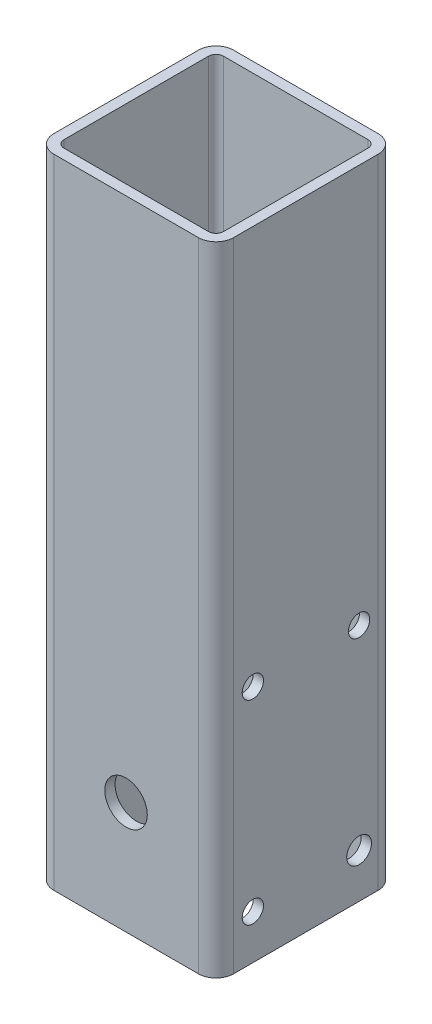
ISO-10303-21;
HEADER;
FILE_DESCRIPTION(('STEP AP214'),'2;1');
FILE_NAME('part.step','',(''),(''),'','','');
FILE_SCHEMA(('AUTOMOTIVE_DESIGN { 1 0 10303 214 1 1 1 1 }'));
ENDSEC;
DATA;
#1=APPLICATION_CONTEXT('core data for automotive mechanical design processes');
#2=APPLICATION_PROTOCOL_DEFINITION('international standard','automotive_design',2000,#1);
#3=PRODUCT_CONTEXT('',#1,'mechanical');
#4=PRODUCT('Part','Part','',(#3));
#5=PRODUCT_RELATED_PRODUCT_CATEGORY('part','',(#4));
#6=PRODUCT_DEFINITION_FORMATION('','',#4);
#7=PRODUCT_DEFINITION_CONTEXT('part definition',#1,'design');
#8=PRODUCT_DEFINITION('design','',#6,#7);
#9=PRODUCT_DEFINITION_SHAPE('','',#8);
#10=(LENGTH_UNIT() NAMED_UNIT(*) SI_UNIT(.MILLI.,.METRE.));
#11=(NAMED_UNIT(*) PLANE_ANGLE_UNIT() SI_UNIT($,.RADIAN.));
#12=(NAMED_UNIT(*) SI_UNIT($,.STERADIAN.) SOLID_ANGLE_UNIT());
#13=UNCERTAINTY_MEASURE_WITH_UNIT(LENGTH_MEASURE(1.E-05),#10,'distance_accuracy_value','');
#14=(GEOMETRIC_REPRESENTATION_CONTEXT(3) GLOBAL_UNCERTAINTY_ASSIGNED_CONTEXT((#13)) GLOBAL_UNIT_ASSIGNED_CONTEXT((#10,
#11,#12)) REPRESENTATION_CONTEXT('',''));
#15=CARTESIAN_POINT('',(0.,0.,0.));
#16=DIRECTION('',(0.,0.,1.));
#17=DIRECTION('',(1.,0.,0.));
#18=AXIS2_PLACEMENT_3D('',#15,#16,#17);
#19=CARTESIAN_POINT('',(-20.4,180.,20.4));
#20=DIRECTION('',(0.,1.,0.));
#21=DIRECTION('',(0.,0.,1.));
#22=AXIS2_PLACEMENT_3D('',#19,#20,#21);
#23=PLANE('',#22);
#24=CARTESIAN_POINT('',(-20.4,180.,20.4));
#25=DIRECTION('',(0.,1.,0.));
#26=DIRECTION('',(0.,0.,1.));
#27=AXIS2_PLACEMENT_3D('',#24,#25,#26);
#28=CIRCLE('',#27,5.);
#29=CARTESIAN_POINT('',(-25.4,180.,20.4));
#30=VERTEX_POINT('',#29);
#31=CARTESIAN_POINT('',(-20.4,180.,25.4));
#32=VERTEX_POINT('',#31);
#33=EDGE_CURVE('E221',#30,#32,#28,.T.);
#34=ORIENTED_EDGE('',*,*,#33,.T.);
#35=DIRECTION('',(1.,0.,0.));
#36=VECTOR('',#35,1.);
#37=CARTESIAN_POINT('',(-20.4,180.,25.4));
#38=LINE('',#37,#36);
#39=CARTESIAN_POINT('',(20.4,180.,25.4));
#40=VERTEX_POINT('',#39);
#41=EDGE_CURVE('E224',#32,#40,#38,.T.);
#42=ORIENTED_EDGE('',*,*,#41,.T.);
#43=CARTESIAN_POINT('',(20.4,180.,20.4));
#44=DIRECTION('',(0.,1.,0.));
#45=DIRECTION('',(0.,0.,1.));
#46=AXIS2_PLACEMENT_3D('',#43,#44,#45);
#47=CIRCLE('',#46,5.);
#48=CARTESIAN_POINT('',(25.4,180.,20.4));
#49=VERTEX_POINT('',#48);
#50=EDGE_CURVE('E227',#40,#49,#47,.T.);
#51=ORIENTED_EDGE('',*,*,#50,.T.);
#52=DIRECTION('',(0.,0.,-1.));
#53=VECTOR('',#52,1.);
#54=CARTESIAN_POINT('',(25.4,180.,-20.4));
#55=LINE('',#54,#53);
#56=CARTESIAN_POINT('',(25.4,180.,-20.4));
#57=VERTEX_POINT('',#56);
#58=EDGE_CURVE('E229',#49,#57,#55,.T.);
#59=ORIENTED_EDGE('',*,*,#58,.T.);
#60=CARTESIAN_POINT('',(20.4,180.,-20.4));
#61=DIRECTION('',(0.,1.,0.));
#62=DIRECTION('',(0.,0.,-1.));
#63=AXIS2_PLACEMENT_3D('',#60,#61,#62);
#64=CIRCLE('',#63,5.);
#65=CARTESIAN_POINT('',(20.4,180.,-25.4));
#66=VERTEX_POINT('',#65);
#67=EDGE_CURVE('E231',#57,#66,#64,.T.);
#68=ORIENTED_EDGE('',*,*,#67,.T.);
#69=DIRECTION('',(-1.,0.,0.));
#70=VECTOR('',#69,1.);
#71=CARTESIAN_POINT('',(-20.4,180.,-25.4));
#72=LINE('',#71,#70);
#73=CARTESIAN_POINT('',(-20.4,180.,-25.4));
#74=VERTEX_POINT('',#73);
#75=EDGE_CURVE('E233',#66,#74,#72,.T.);
#76=ORIENTED_EDGE('',*,*,#75,.T.);
#77=CARTESIAN_POINT('',(-20.4,180.,-20.4));
#78=DIRECTION('',(0.,1.,0.));
#79=DIRECTION('',(0.,0.,1.));
#80=AXIS2_PLACEMENT_3D('',#77,#78,#79);
#81=CIRCLE('',#80,5.);
#82=CARTESIAN_POINT('',(-25.4,180.,-20.4));
#83=VERTEX_POINT('',#82);
#84=EDGE_CURVE('E235',#74,#83,#81,.T.);
#85=ORIENTED_EDGE('',*,*,#84,.T.);
#86=DIRECTION('',(0.,0.,1.));
#87=VECTOR('',#86,1.);
#88=CARTESIAN_POINT('',(-25.4,180.,-20.4));
#89=LINE('',#88,#87);
#90=EDGE_CURVE('E237',#83,#30,#89,.T.);
#91=ORIENTED_EDGE('',*,*,#90,.T.);
#92=EDGE_LOOP('',(#34,#42,#51,#59,#68,#76,#85,#91));
#93=FACE_BOUND('',#92,.T.);
#94=DIRECTION('',(0.,0.,1.));
#95=VECTOR('',#94,1.);
#96=CARTESIAN_POINT('',(-22.5,180.,-20.4));
#97=LINE('',#96,#95);
#98=CARTESIAN_POINT('',(-22.5,180.,-20.4));
#99=VERTEX_POINT('',#98);
#100=CARTESIAN_POINT('',(-22.5,180.,20.4));
#101=VERTEX_POINT('',#100);
#102=EDGE_CURVE('E162',#99,#101,#97,.T.);
#103=ORIENTED_EDGE('',*,*,#102,.F.);
#104=CARTESIAN_POINT('',(-20.4,180.,-20.4));
#105=DIRECTION('',(0.,1.,0.));
#106=DIRECTION('',(0.,0.,1.));
#107=AXIS2_PLACEMENT_3D('',#104,#105,#106);
#108=CIRCLE('',#107,2.1);
#109=CARTESIAN_POINT('',(-20.4,180.,-22.5));
#110=VERTEX_POINT('',#109);
#111=EDGE_CURVE('E154',#110,#99,#108,.T.);
#112=ORIENTED_EDGE('',*,*,#111,.F.);
#113=DIRECTION('',(-1.,0.,0.));
#114=VECTOR('',#113,1.);
#115=CARTESIAN_POINT('',(-20.4,180.,-22.5));
#116=LINE('',#115,#114);
#117=CARTESIAN_POINT('',(20.4,180.,-22.5));
#118=VERTEX_POINT('',#117);
#119=EDGE_CURVE('E188',#118,#110,#116,.T.);
#120=ORIENTED_EDGE('',*,*,#119,.F.);
#121=CARTESIAN_POINT('',(20.4,180.,-20.4));
#122=DIRECTION('',(0.,1.,0.));
#123=DIRECTION('',(0.,0.,-1.));
#124=AXIS2_PLACEMENT_3D('',#121,#122,#123);
#125=CIRCLE('',#124,2.1);
#126=CARTESIAN_POINT('',(22.5,180.,-20.4));
#127=VERTEX_POINT('',#126);
#128=EDGE_CURVE('E186',#127,#118,#125,.T.);
#129=ORIENTED_EDGE('',*,*,#128,.F.);
#130=DIRECTION('',(0.,0.,-1.));
#131=VECTOR('',#130,1.);
#132=CARTESIAN_POINT('',(22.5,180.,-20.4));
#133=LINE('',#132,#131);
#134=CARTESIAN_POINT('',(22.5,180.,20.4));
#135=VERTEX_POINT('',#134);
#136=EDGE_CURVE('E184',#135,#127,#133,.T.);
#137=ORIENTED_EDGE('',*,*,#136,.F.);
#138=CARTESIAN_POINT('',(20.4,180.,20.4));
#139=DIRECTION('',(0.,1.,0.));
#140=DIRECTION('',(0.,0.,1.));
#141=AXIS2_PLACEMENT_3D('',#138,#139,#140);
#142=CIRCLE('',#141,2.1);
#143=CARTESIAN_POINT('',(20.4,180.,22.5));
#144=VERTEX_POINT('',#143);
#145=EDGE_CURVE('E182',#144,#135,#142,.T.);
#146=ORIENTED_EDGE('',*,*,#145,.F.);
#147=DIRECTION('',(1.,0.,0.));
#148=VECTOR('',#147,1.);
#149=CARTESIAN_POINT('',(-20.4,180.,22.5));
#150=LINE('',#149,#148);
#151=CARTESIAN_POINT('',(-20.4,180.,22.5));
#152=VERTEX_POINT('',#151);
#153=EDGE_CURVE('E177',#152,#144,#150,.T.);
#154=ORIENTED_EDGE('',*,*,#153,.F.);
#155=CARTESIAN_POINT('',(-20.4,180.,20.4));
#156=DIRECTION('',(0.,1.,0.));
#157=DIRECTION('',(0.,0.,1.));
#158=AXIS2_PLACEMENT_3D('',#155,#156,#157);
#159=CIRCLE('',#158,2.1);
#160=EDGE_CURVE('E175',#101,#152,#159,.T.);
#161=ORIENTED_EDGE('',*,*,#160,.F.);
#162=EDGE_LOOP('',(#103,#112,#120,#129,#137,#146,#154,#161));
#163=FACE_BOUND('',#162,.T.);
#164=ADVANCED_FACE('F39',(#93,#163),#23,.T.);
#165=CARTESIAN_POINT('',(-20.4,0.,20.4));
#166=DIRECTION('',(0.,1.,0.));
#167=DIRECTION('',(0.,0.,1.));
#168=AXIS2_PLACEMENT_3D('',#165,#166,#167);
#169=PLANE('',#168);
#170=CARTESIAN_POINT('',(-20.4,0.,20.4));
#171=DIRECTION('',(0.,1.,0.));
#172=DIRECTION('',(0.,0.,1.));
#173=AXIS2_PLACEMENT_3D('',#170,#171,#172);
#174=CIRCLE('',#173,5.);
#175=CARTESIAN_POINT('',(-25.4,0.,20.4));
#176=VERTEX_POINT('',#175);
#177=CARTESIAN_POINT('',(-20.4,0.,25.4));
#178=VERTEX_POINT('',#177);
#179=EDGE_CURVE('E170',#176,#178,#174,.T.);
#180=ORIENTED_EDGE('',*,*,#179,.F.);
#181=DIRECTION('',(0.,0.,1.));
#182=VECTOR('',#181,1.);
#183=CARTESIAN_POINT('',(-25.4,0.,-20.4));
#184=LINE('',#183,#182);
#185=CARTESIAN_POINT('',(-25.4,0.,-20.4));
#186=VERTEX_POINT('',#185);
#187=EDGE_CURVE('E225',#186,#176,#184,.T.);
#188=ORIENTED_EDGE('',*,*,#187,.F.);
#189=CARTESIAN_POINT('',(-20.4,0.,-20.4));
#190=DIRECTION('',(0.,1.,0.));
#191=DIRECTION('',(0.,0.,1.));
#192=AXIS2_PLACEMENT_3D('',#189,#190,#191);
#193=CIRCLE('',#192,5.);
#194=CARTESIAN_POINT('',(-20.4,0.,-25.4));
#195=VERTEX_POINT('',#194);
#196=EDGE_CURVE('E252',#195,#186,#193,.T.);
#197=ORIENTED_EDGE('',*,*,#196,.F.);
#198=DIRECTION('',(-1.,0.,0.));
#199=VECTOR('',#198,1.);
#200=CARTESIAN_POINT('',(-20.4,0.,-25.4));
#201=LINE('',#200,#199);
#202=CARTESIAN_POINT('',(20.4,0.,-25.4));
#203=VERTEX_POINT('',#202);
#204=EDGE_CURVE('E250',#203,#195,#201,.T.);
#205=ORIENTED_EDGE('',*,*,#204,.F.);
#206=CARTESIAN_POINT('',(20.4,0.,-20.4));
#207=DIRECTION('',(0.,1.,0.));
#208=DIRECTION('',(0.,0.,-1.));
#209=AXIS2_PLACEMENT_3D('',#206,#207,#208);
#210=CIRCLE('',#209,5.);
#211=CARTESIAN_POINT('',(25.4,0.,-20.4));
#212=VERTEX_POINT('',#211);
#213=EDGE_CURVE('E248',#212,#203,#210,.T.);
#214=ORIENTED_EDGE('',*,*,#213,.F.);
#215=DIRECTION('',(0.,0.,-1.));
#216=VECTOR('',#215,1.);
#217=CARTESIAN_POINT('',(25.4,0.,-20.4));
#218=LINE('',#217,#216);
#219=CARTESIAN_POINT('',(25.4,0.,20.4));
#220=VERTEX_POINT('',#219);
#221=EDGE_CURVE('E246',#220,#212,#218,.T.);
#222=ORIENTED_EDGE('',*,*,#221,.F.);
#223=CARTESIAN_POINT('',(20.4,0.,20.4));
#224=DIRECTION('',(0.,1.,0.));
#225=DIRECTION('',(0.,0.,1.));
#226=AXIS2_PLACEMENT_3D('',#223,#224,#225);
#227=CIRCLE('',#226,5.);
#228=CARTESIAN_POINT('',(20.4,0.,25.4));
#229=VERTEX_POINT('',#228);
#230=EDGE_CURVE('E244',#229,#220,#227,.T.);
#231=ORIENTED_EDGE('',*,*,#230,.F.);
#232=DIRECTION('',(1.,0.,0.));
#233=VECTOR('',#232,1.);
#234=CARTESIAN_POINT('',(-20.4,0.,25.4));
#235=LINE('',#234,#233);
#236=EDGE_CURVE('E242',#178,#229,#235,.T.);
#237=ORIENTED_EDGE('',*,*,#236,.F.);
#238=EDGE_LOOP('',(#180,#188,#197,#205,#214,#222,#231,#237));
#239=FACE_BOUND('',#238,.T.);
#240=CARTESIAN_POINT('',(-20.4,0.,-20.4));
#241=DIRECTION('',(0.,1.,0.));
#242=DIRECTION('',(0.,0.,1.));
#243=AXIS2_PLACEMENT_3D('',#240,#241,#242);
#244=CIRCLE('',#243,2.1);
#245=CARTESIAN_POINT('',(-20.4,0.,-22.5));
#246=VERTEX_POINT('',#245);
#247=CARTESIAN_POINT('',(-22.5,0.,-20.4));
#248=VERTEX_POINT('',#247);
#249=EDGE_CURVE('E64',#246,#248,#244,.T.);
#250=ORIENTED_EDGE('',*,*,#249,.T.);
#251=DIRECTION('',(0.,0.,1.));
#252=VECTOR('',#251,1.);
#253=CARTESIAN_POINT('',(-22.5,0.,-20.4));
#254=LINE('',#253,#252);
#255=CARTESIAN_POINT('',(-22.5,0.,20.4));
#256=VERTEX_POINT('',#255);
#257=EDGE_CURVE('E169',#248,#256,#254,.T.);
#258=ORIENTED_EDGE('',*,*,#257,.T.);
#259=CARTESIAN_POINT('',(-20.4,0.,20.4));
#260=DIRECTION('',(0.,1.,0.));
#261=DIRECTION('',(0.,0.,1.));
#262=AXIS2_PLACEMENT_3D('',#259,#260,#261);
#263=CIRCLE('',#262,2.1);
#264=CARTESIAN_POINT('',(-20.4,0.,22.5));
#265=VERTEX_POINT('',#264);
#266=EDGE_CURVE('E193',#256,#265,#263,.T.);
#267=ORIENTED_EDGE('',*,*,#266,.T.);
#268=DIRECTION('',(1.,0.,0.));
#269=VECTOR('',#268,1.);
#270=CARTESIAN_POINT('',(-20.4,0.,22.5));
#271=LINE('',#270,#269);
#272=CARTESIAN_POINT('',(20.4,0.,22.5));
#273=VERTEX_POINT('',#272);
#274=EDGE_CURVE('E196',#265,#273,#271,.T.);
#275=ORIENTED_EDGE('',*,*,#274,.T.);
#276=CARTESIAN_POINT('',(20.4,0.,20.4));
#277=DIRECTION('',(0.,1.,0.));
#278=DIRECTION('',(0.,0.,1.));
#279=AXIS2_PLACEMENT_3D('',#276,#277,#278);
#280=CIRCLE('',#279,2.1);
#281=CARTESIAN_POINT('',(22.5,0.,20.4));
#282=VERTEX_POINT('',#281);
#283=EDGE_CURVE('E199',#273,#282,#280,.T.);
#284=ORIENTED_EDGE('',*,*,#283,.T.);
#285=DIRECTION('',(0.,0.,-1.));
#286=VECTOR('',#285,1.);
#287=CARTESIAN_POINT('',(22.5,0.,-20.4));
#288=LINE('',#287,#286);
#289=CARTESIAN_POINT('',(22.5,0.,-20.4));
#290=VERTEX_POINT('',#289);
#291=EDGE_CURVE('E202',#282,#290,#288,.T.);
#292=ORIENTED_EDGE('',*,*,#291,.T.);
#293=CARTESIAN_POINT('',(20.4,0.,-20.4));
#294=DIRECTION('',(0.,1.,0.));
#295=DIRECTION('',(0.,0.,-1.));
#296=AXIS2_PLACEMENT_3D('',#293,#294,#295);
#297=CIRCLE('',#296,2.1);
#298=CARTESIAN_POINT('',(20.4,0.,-22.5));
#299=VERTEX_POINT('',#298);
#300=EDGE_CURVE('E205',#290,#299,#297,.T.);
#301=ORIENTED_EDGE('',*,*,#300,.T.);
#302=DIRECTION('',(-1.,0.,0.));
#303=VECTOR('',#302,1.);
#304=CARTESIAN_POINT('',(-20.4,0.,-22.5));
#305=LINE('',#304,#303);
#306=EDGE_CURVE('E163',#299,#246,#305,.T.);
#307=ORIENTED_EDGE('',*,*,#306,.T.);
#308=EDGE_LOOP('',(#250,#258,#267,#275,#284,#292,#301,#307));
#309=FACE_BOUND('',#308,.T.);
#310=ADVANCED_FACE('F331',(#239,#309),#169,.F.);
#311=CARTESIAN_POINT('',(-20.4,180.,20.4));
#312=DIRECTION('',(0.,-1.,0.));
#313=DIRECTION('',(0.,0.,-1.));
#314=AXIS2_PLACEMENT_3D('',#311,#312,#313);
#315=CYLINDRICAL_SURFACE('',#314,5.);
#316=ORIENTED_EDGE('',*,*,#179,.T.);
#317=DIRECTION('',(0.,-1.,0.));
#318=VECTOR('',#317,1.);
#319=CARTESIAN_POINT('',(-20.4,180.,25.4));
#320=LINE('',#319,#318);
#321=EDGE_CURVE('E11',#32,#178,#320,.T.);
#322=ORIENTED_EDGE('',*,*,#321,.F.);
#323=ORIENTED_EDGE('',*,*,#33,.F.);
#324=DIRECTION('',(0.,-1.,0.));
#325=VECTOR('',#324,1.);
#326=CARTESIAN_POINT('',(-25.4,180.,20.4));
#327=LINE('',#326,#325);
#328=EDGE_CURVE('E239',#30,#176,#327,.T.);
#329=ORIENTED_EDGE('',*,*,#328,.T.);
#330=EDGE_LOOP('',(#316,#322,#323,#329));
#331=FACE_BOUND('',#330,.T.);
#332=ADVANCED_FACE('F41',(#331),#315,.T.);
#333=CARTESIAN_POINT('',(-20.4,180.,25.4));
#334=DIRECTION('',(0.,0.,-1.));
#335=DIRECTION('',(-1.,0.,0.));
#336=AXIS2_PLACEMENT_3D('',#333,#334,#335);
#337=PLANE('',#336);
#338=CARTESIAN_POINT('',(0.,31.67,25.4));
#339=DIRECTION('',(0.,0.,1.));
#340=DIRECTION('',(1.,0.,0.));
#341=AXIS2_PLACEMENT_3D('',#338,#339,#340);
#342=CIRCLE('',#341,6.);
#343=CARTESIAN_POINT('',(6.00000000000001,31.67,25.4));
#344=VERTEX_POINT('',#343);
#345=EDGE_CURVE('E373',#344,#344,#342,.T.);
#346=ORIENTED_EDGE('',*,*,#345,.F.);
#347=EDGE_LOOP('',(#346));
#348=FACE_BOUND('',#347,.T.);
#349=ORIENTED_EDGE('',*,*,#236,.T.);
#350=DIRECTION('',(0.,-1.,0.));
#351=VECTOR('',#350,1.);
#352=CARTESIAN_POINT('',(20.4,180.,25.4));
#353=LINE('',#352,#351);
#354=EDGE_CURVE('E48',#40,#229,#353,.T.);
#355=ORIENTED_EDGE('',*,*,#354,.F.);
#356=ORIENTED_EDGE('',*,*,#41,.F.);
#357=ORIENTED_EDGE('',*,*,#321,.T.);
#358=EDGE_LOOP('',(#349,#355,#356,#357));
#359=FACE_BOUND('',#358,.T.);
#360=ADVANCED_FACE('F362',(#348,#359),#337,.F.);
#361=CARTESIAN_POINT('',(20.4,180.,20.4));
#362=DIRECTION('',(0.,-1.,0.));
#363=DIRECTION('',(0.,0.,-1.));
#364=AXIS2_PLACEMENT_3D('',#361,#362,#363);
#365=CYLINDRICAL_SURFACE('',#364,5.);
#366=ORIENTED_EDGE('',*,*,#230,.T.);
#367=DIRECTION('',(0.,-1.,0.));
#368=VECTOR('',#367,1.);
#369=CARTESIAN_POINT('',(25.4,180.,20.4));
#370=LINE('',#369,#368);
#371=EDGE_CURVE('E269',#49,#220,#370,.T.);
#372=ORIENTED_EDGE('',*,*,#371,.F.);
#373=ORIENTED_EDGE('',*,*,#50,.F.);
#374=ORIENTED_EDGE('',*,*,#354,.T.);
#375=EDGE_LOOP('',(#366,#372,#373,#374));
#376=FACE_BOUND('',#375,.T.);
#377=ADVANCED_FACE('F360',(#376),#365,.T.);
#378=CARTESIAN_POINT('',(25.4,180.,-20.4));
#379=DIRECTION('',(-1.,0.,0.));
#380=DIRECTION('',(0.,0.,1.));
#381=AXIS2_PLACEMENT_3D('',#378,#379,#380);
#382=PLANE('',#381);
#383=CARTESIAN_POINT('',(25.4,67.5,15.));
#384=DIRECTION('',(-1.,0.,0.));
#385=DIRECTION('',(0.,0.,1.));
#386=AXIS2_PLACEMENT_3D('',#383,#384,#385);
#387=CIRCLE('',#386,3.);
#388=CARTESIAN_POINT('',(25.4,67.5,18.));
#389=VERTEX_POINT('',#388);
#390=EDGE_CURVE('E191',#389,#389,#387,.T.);
#391=ORIENTED_EDGE('',*,*,#390,.T.);
#392=EDGE_LOOP('',(#391));
#393=FACE_BOUND('',#392,.T.);
#394=CARTESIAN_POINT('',(25.4,12.5,-15.));
#395=DIRECTION('',(-1.,0.,0.));
#396=DIRECTION('',(0.,0.,1.));
#397=AXIS2_PLACEMENT_3D('',#394,#395,#396);
#398=CIRCLE('',#397,3.5);
#399=CARTESIAN_POINT('',(25.4,12.5,-11.5));
#400=VERTEX_POINT('',#399);
#401=EDGE_CURVE('E291',#400,#400,#398,.T.);
#402=ORIENTED_EDGE('',*,*,#401,.T.);
#403=EDGE_LOOP('',(#402));
#404=FACE_BOUND('',#403,.T.);
#405=CARTESIAN_POINT('',(25.4,12.5,15.));
#406=DIRECTION('',(-1.,0.,0.));
#407=DIRECTION('',(0.,0.,1.));
#408=AXIS2_PLACEMENT_3D('',#405,#406,#407);
#409=CIRCLE('',#408,3.);
#410=CARTESIAN_POINT('',(25.4,12.5,18.));
#411=VERTEX_POINT('',#410);
#412=EDGE_CURVE('E287',#411,#411,#409,.T.);
#413=ORIENTED_EDGE('',*,*,#412,.T.);
#414=EDGE_LOOP('',(#413));
#415=FACE_BOUND('',#414,.T.);
#416=CARTESIAN_POINT('',(25.4,67.5,-15.));
#417=DIRECTION('',(-1.,0.,0.));
#418=DIRECTION('',(0.,0.,1.));
#419=AXIS2_PLACEMENT_3D('',#416,#417,#418);
#420=CIRCLE('',#419,3.);
#421=CARTESIAN_POINT('',(25.4,67.5,-12.));
#422=VERTEX_POINT('',#421);
#423=EDGE_CURVE('E283',#422,#422,#420,.T.);
#424=ORIENTED_EDGE('',*,*,#423,.T.);
#425=EDGE_LOOP('',(#424));
#426=FACE_BOUND('',#425,.T.);
#427=ORIENTED_EDGE('',*,*,#221,.T.);
#428=DIRECTION('',(0.,-1.,0.));
#429=VECTOR('',#428,1.);
#430=CARTESIAN_POINT('',(25.4,180.,-20.4));
#431=LINE('',#430,#429);
#432=EDGE_CURVE('E266',#57,#212,#431,.T.);
#433=ORIENTED_EDGE('',*,*,#432,.F.);
#434=ORIENTED_EDGE('',*,*,#58,.F.);
#435=ORIENTED_EDGE('',*,*,#371,.T.);
#436=EDGE_LOOP('',(#427,#433,#434,#435));
#437=FACE_BOUND('',#436,.T.);
#438=ADVANCED_FACE('F306',(#393,#404,#415,#426,#437),#382,.F.);
#439=CARTESIAN_POINT('',(20.4,180.,-20.4));
#440=DIRECTION('',(0.,-1.,0.));
#441=DIRECTION('',(0.,0.,-1.));
#442=AXIS2_PLACEMENT_3D('',#439,#440,#441);
#443=CYLINDRICAL_SURFACE('',#442,5.);
#444=ORIENTED_EDGE('',*,*,#213,.T.);
#445=DIRECTION('',(0.,-1.,0.));
#446=VECTOR('',#445,1.);
#447=CARTESIAN_POINT('',(20.4,180.,-25.4));
#448=LINE('',#447,#446);
#449=EDGE_CURVE('E263',#66,#203,#448,.T.);
#450=ORIENTED_EDGE('',*,*,#449,.F.);
#451=ORIENTED_EDGE('',*,*,#67,.F.);
#452=ORIENTED_EDGE('',*,*,#432,.T.);
#453=EDGE_LOOP('',(#444,#450,#451,#452));
#454=FACE_BOUND('',#453,.T.);
#455=ADVANCED_FACE('F353',(#454),#443,.T.);
#456=CARTESIAN_POINT('',(-20.4,180.,-25.4));
#457=DIRECTION('',(0.,0.,1.));
#458=DIRECTION('',(1.,0.,0.));
#459=AXIS2_PLACEMENT_3D('',#456,#457,#458);
#460=PLANE('',#459);
#461=CARTESIAN_POINT('',(0.,31.67,-25.4));
#462=DIRECTION('',(0.,0.,1.));
#463=DIRECTION('',(1.,0.,0.));
#464=AXIS2_PLACEMENT_3D('',#461,#462,#463);
#465=CIRCLE('',#464,6.);
#466=CARTESIAN_POINT('',(6.00000000000001,31.67,-25.4));
#467=VERTEX_POINT('',#466);
#468=EDGE_CURVE('E483',#467,#467,#465,.T.);
#469=ORIENTED_EDGE('',*,*,#468,.T.);
#470=EDGE_LOOP('',(#469));
#471=FACE_BOUND('',#470,.T.);
#472=ORIENTED_EDGE('',*,*,#204,.T.);
#473=DIRECTION('',(0.,-1.,0.));
#474=VECTOR('',#473,1.);
#475=CARTESIAN_POINT('',(-20.4,180.,-25.4));
#476=LINE('',#475,#474);
#477=EDGE_CURVE('E260',#74,#195,#476,.T.);
#478=ORIENTED_EDGE('',*,*,#477,.F.);
#479=ORIENTED_EDGE('',*,*,#75,.F.);
#480=ORIENTED_EDGE('',*,*,#449,.T.);
#481=EDGE_LOOP('',(#472,#478,#479,#480));
#482=FACE_BOUND('',#481,.T.);
#483=ADVANCED_FACE('F349',(#471,#482),#460,.F.);
#484=CARTESIAN_POINT('',(-20.4,180.,-20.4));
#485=DIRECTION('',(0.,-1.,0.));
#486=DIRECTION('',(0.,0.,-1.));
#487=AXIS2_PLACEMENT_3D('',#484,#485,#486);
#488=CYLINDRICAL_SURFACE('',#487,5.);
#489=ORIENTED_EDGE('',*,*,#196,.T.);
#490=DIRECTION('',(0.,-1.,0.));
#491=VECTOR('',#490,1.);
#492=CARTESIAN_POINT('',(-25.4,180.,-20.4));
#493=LINE('',#492,#491);
#494=EDGE_CURVE('E257',#83,#186,#493,.T.);
#495=ORIENTED_EDGE('',*,*,#494,.F.);
#496=ORIENTED_EDGE('',*,*,#84,.F.);
#497=ORIENTED_EDGE('',*,*,#477,.T.);
#498=EDGE_LOOP('',(#489,#495,#496,#497));
#499=FACE_BOUND('',#498,.T.);
#500=ADVANCED_FACE('F345',(#499),#488,.T.);
#501=CARTESIAN_POINT('',(-25.4,180.,-20.4));
#502=DIRECTION('',(1.,0.,0.));
#503=DIRECTION('',(0.,0.,-1.));
#504=AXIS2_PLACEMENT_3D('',#501,#502,#503);
#505=PLANE('',#504);
#506=CARTESIAN_POINT('',(-25.4,67.5,15.));
#507=DIRECTION('',(-1.,0.,0.));
#508=DIRECTION('',(0.,0.,1.));
#509=AXIS2_PLACEMENT_3D('',#506,#507,#508);
#510=CIRCLE('',#509,3.);
#511=CARTESIAN_POINT('',(-25.4,67.5,18.));
#512=VERTEX_POINT('',#511);
#513=EDGE_CURVE('E473',#512,#512,#510,.T.);
#514=ORIENTED_EDGE('',*,*,#513,.F.);
#515=EDGE_LOOP('',(#514));
#516=FACE_BOUND('',#515,.T.);
#517=CARTESIAN_POINT('',(-25.4,12.5,-15.));
#518=DIRECTION('',(-1.,0.,0.));
#519=DIRECTION('',(0.,0.,1.));
#520=AXIS2_PLACEMENT_3D('',#517,#518,#519);
#521=CIRCLE('',#520,3.5);
#522=CARTESIAN_POINT('',(-25.4,12.5,-11.5));
#523=VERTEX_POINT('',#522);
#524=EDGE_CURVE('E475',#523,#523,#521,.T.);
#525=ORIENTED_EDGE('',*,*,#524,.F.);
#526=EDGE_LOOP('',(#525));
#527=FACE_BOUND('',#526,.T.);
#528=CARTESIAN_POINT('',(-25.4,12.5,15.0000000000001));
#529=DIRECTION('',(-1.,0.,0.));
#530=DIRECTION('',(0.,0.,1.));
#531=AXIS2_PLACEMENT_3D('',#528,#529,#530);
#532=CIRCLE('',#531,3.);
#533=CARTESIAN_POINT('',(-25.4,12.5,18.0000000000001));
#534=VERTEX_POINT('',#533);
#535=EDGE_CURVE('E479',#534,#534,#532,.T.);
#536=ORIENTED_EDGE('',*,*,#535,.F.);
#537=EDGE_LOOP('',(#536));
#538=FACE_BOUND('',#537,.T.);
#539=CARTESIAN_POINT('',(-25.4,67.5,-15.));
#540=DIRECTION('',(-1.,0.,0.));
#541=DIRECTION('',(0.,0.,1.));
#542=AXIS2_PLACEMENT_3D('',#539,#540,#541);
#543=CIRCLE('',#542,3.);
#544=CARTESIAN_POINT('',(-25.4,67.5,-12.));
#545=VERTEX_POINT('',#544);
#546=EDGE_CURVE('E278',#545,#545,#543,.T.);
#547=ORIENTED_EDGE('',*,*,#546,.F.);
#548=EDGE_LOOP('',(#547));
#549=FACE_BOUND('',#548,.T.);
#550=ORIENTED_EDGE('',*,*,#187,.T.);
#551=ORIENTED_EDGE('',*,*,#328,.F.);
#552=ORIENTED_EDGE('',*,*,#90,.F.);
#553=ORIENTED_EDGE('',*,*,#494,.T.);
#554=EDGE_LOOP('',(#550,#551,#552,#553));
#555=FACE_BOUND('',#554,.T.);
#556=ADVANCED_FACE('F342',(#516,#527,#538,#549,#555),#505,.F.);
#557=CARTESIAN_POINT('',(-20.4,180.,-20.4));
#558=DIRECTION('',(0.,-1.,0.));
#559=DIRECTION('',(0.,0.,-1.));
#560=AXIS2_PLACEMENT_3D('',#557,#558,#559);
#561=CYLINDRICAL_SURFACE('',#560,2.1);
#562=ORIENTED_EDGE('',*,*,#249,.F.);
#563=DIRECTION('',(0.,-1.,0.));
#564=VECTOR('',#563,1.);
#565=CARTESIAN_POINT('',(-20.4,180.,-22.5));
#566=LINE('',#565,#564);
#567=EDGE_CURVE('E158',#110,#246,#566,.T.);
#568=ORIENTED_EDGE('',*,*,#567,.F.);
#569=ORIENTED_EDGE('',*,*,#111,.T.);
#570=DIRECTION('',(0.,-1.,0.));
#571=VECTOR('',#570,1.);
#572=CARTESIAN_POINT('',(-22.5,180.,-20.4));
#573=LINE('',#572,#571);
#574=EDGE_CURVE('E157',#99,#248,#573,.T.);
#575=ORIENTED_EDGE('',*,*,#574,.T.);
#576=EDGE_LOOP('',(#562,#568,#569,#575));
#577=FACE_BOUND('',#576,.T.);
#578=ADVANCED_FACE('F156',(#577),#561,.F.);
#579=CARTESIAN_POINT('',(-22.5,180.,-20.4));
#580=DIRECTION('',(1.,0.,0.));
#581=DIRECTION('',(0.,0.,-1.));
#582=AXIS2_PLACEMENT_3D('',#579,#580,#581);
#583=PLANE('',#582);
#584=CARTESIAN_POINT('',(-22.5,67.5,15.));
#585=DIRECTION('',(1.,0.,0.));
#586=DIRECTION('',(0.,0.,-1.));
#587=AXIS2_PLACEMENT_3D('',#584,#585,#586);
#588=CIRCLE('',#587,3.);
#589=CARTESIAN_POINT('',(-22.5,67.5,12.));
#590=VERTEX_POINT('',#589);
#591=EDGE_CURVE('E290',#590,#590,#588,.T.);
#592=ORIENTED_EDGE('',*,*,#591,.F.);
#593=EDGE_LOOP('',(#592));
#594=FACE_BOUND('',#593,.T.);
#595=CARTESIAN_POINT('',(-22.5,12.5,-15.));
#596=DIRECTION('',(1.,0.,0.));
#597=DIRECTION('',(0.,0.,-1.));
#598=AXIS2_PLACEMENT_3D('',#595,#596,#597);
#599=CIRCLE('',#598,3.5);
#600=CARTESIAN_POINT('',(-22.5,12.5,-18.5));
#601=VERTEX_POINT('',#600);
#602=EDGE_CURVE('E286',#601,#601,#599,.T.);
#603=ORIENTED_EDGE('',*,*,#602,.F.);
#604=EDGE_LOOP('',(#603));
#605=FACE_BOUND('',#604,.T.);
#606=CARTESIAN_POINT('',(-22.5,12.5,15.0000000000001));
#607=DIRECTION('',(1.,0.,0.));
#608=DIRECTION('',(0.,0.,-1.));
#609=AXIS2_PLACEMENT_3D('',#606,#607,#608);
#610=CIRCLE('',#609,3.);
#611=CARTESIAN_POINT('',(-22.5,12.5,12.0000000000001));
#612=VERTEX_POINT('',#611);
#613=EDGE_CURVE('E282',#612,#612,#610,.T.);
#614=ORIENTED_EDGE('',*,*,#613,.F.);
#615=EDGE_LOOP('',(#614));
#616=FACE_BOUND('',#615,.T.);
#617=CARTESIAN_POINT('',(-22.5,67.5,-15.));
#618=DIRECTION('',(1.,0.,0.));
#619=DIRECTION('',(0.,0.,-1.));
#620=AXIS2_PLACEMENT_3D('',#617,#618,#619);
#621=CIRCLE('',#620,3.);
#622=CARTESIAN_POINT('',(-22.5,67.5,-18.));
#623=VERTEX_POINT('',#622);
#624=EDGE_CURVE('E277',#623,#623,#621,.T.);
#625=ORIENTED_EDGE('',*,*,#624,.F.);
#626=EDGE_LOOP('',(#625));
#627=FACE_BOUND('',#626,.T.);
#628=ORIENTED_EDGE('',*,*,#257,.F.);
#629=ORIENTED_EDGE('',*,*,#574,.F.);
#630=ORIENTED_EDGE('',*,*,#102,.T.);
#631=DIRECTION('',(0.,-1.,0.));
#632=VECTOR('',#631,1.);
#633=CARTESIAN_POINT('',(-22.5,180.,20.4));
#634=LINE('',#633,#632);
#635=EDGE_CURVE('E171',#101,#256,#634,.T.);
#636=ORIENTED_EDGE('',*,*,#635,.T.);
#637=EDGE_LOOP('',(#628,#629,#630,#636));
#638=FACE_BOUND('',#637,.T.);
#639=ADVANCED_FACE('F166',(#594,#605,#616,#627,#638),#583,.T.);
#640=CARTESIAN_POINT('',(-20.4,180.,20.4));
#641=DIRECTION('',(0.,-1.,0.));
#642=DIRECTION('',(0.,0.,-1.));
#643=AXIS2_PLACEMENT_3D('',#640,#641,#642);
#644=CYLINDRICAL_SURFACE('',#643,2.1);
#645=ORIENTED_EDGE('',*,*,#266,.F.);
#646=ORIENTED_EDGE('',*,*,#635,.F.);
#647=ORIENTED_EDGE('',*,*,#160,.T.);
#648=DIRECTION('',(0.,-1.,0.));
#649=VECTOR('',#648,1.);
#650=CARTESIAN_POINT('',(-20.4,180.,22.5));
#651=LINE('',#650,#649);
#652=EDGE_CURVE('E218',#152,#265,#651,.T.);
#653=ORIENTED_EDGE('',*,*,#652,.T.);
#654=EDGE_LOOP('',(#645,#646,#647,#653));
#655=FACE_BOUND('',#654,.T.);
#656=ADVANCED_FACE('F422',(#655),#644,.F.);
#657=CARTESIAN_POINT('',(-20.4,180.,22.5));
#658=DIRECTION('',(0.,0.,-1.));
#659=DIRECTION('',(-1.,0.,0.));
#660=AXIS2_PLACEMENT_3D('',#657,#658,#659);
#661=PLANE('',#660);
#662=CARTESIAN_POINT('',(0.,31.67,22.5));
#663=DIRECTION('',(0.,0.,-1.));
#664=DIRECTION('',(-1.,0.,0.));
#665=AXIS2_PLACEMENT_3D('',#662,#663,#664);
#666=CIRCLE('',#665,6.);
#667=CARTESIAN_POINT('',(-6.,31.67,22.5));
#668=VERTEX_POINT('',#667);
#669=EDGE_CURVE('E486',#668,#668,#666,.T.);
#670=ORIENTED_EDGE('',*,*,#669,.F.);
#671=EDGE_LOOP('',(#670));
#672=FACE_BOUND('',#671,.T.);
#673=ORIENTED_EDGE('',*,*,#274,.F.);
#674=ORIENTED_EDGE('',*,*,#652,.F.);
#675=ORIENTED_EDGE('',*,*,#153,.T.);
#676=DIRECTION('',(0.,-1.,0.));
#677=VECTOR('',#676,1.);
#678=CARTESIAN_POINT('',(20.4,180.,22.5));
#679=LINE('',#678,#677);
#680=EDGE_CURVE('E216',#144,#273,#679,.T.);
#681=ORIENTED_EDGE('',*,*,#680,.T.);
#682=EDGE_LOOP('',(#673,#674,#675,#681));
#683=FACE_BOUND('',#682,.T.);
#684=ADVANCED_FACE('F419',(#672,#683),#661,.T.);
#685=CARTESIAN_POINT('',(20.4,180.,20.4));
#686=DIRECTION('',(0.,-1.,0.));
#687=DIRECTION('',(0.,0.,-1.));
#688=AXIS2_PLACEMENT_3D('',#685,#686,#687);
#689=CYLINDRICAL_SURFACE('',#688,2.1);
#690=ORIENTED_EDGE('',*,*,#283,.F.);
#691=ORIENTED_EDGE('',*,*,#680,.F.);
#692=ORIENTED_EDGE('',*,*,#145,.T.);
#693=DIRECTION('',(0.,-1.,0.));
#694=VECTOR('',#693,1.);
#695=CARTESIAN_POINT('',(22.5,180.,20.4));
#696=LINE('',#695,#694);
#697=EDGE_CURVE('E214',#135,#282,#696,.T.);
#698=ORIENTED_EDGE('',*,*,#697,.T.);
#699=EDGE_LOOP('',(#690,#691,#692,#698));
#700=FACE_BOUND('',#699,.T.);
#701=ADVANCED_FACE('F414',(#700),#689,.F.);
#702=CARTESIAN_POINT('',(22.5,180.,-20.4));
#703=DIRECTION('',(-1.,0.,0.));
#704=DIRECTION('',(0.,0.,1.));
#705=AXIS2_PLACEMENT_3D('',#702,#703,#704);
#706=PLANE('',#705);
#707=CARTESIAN_POINT('',(22.5,67.5,15.));
#708=DIRECTION('',(-1.,0.,0.));
#709=DIRECTION('',(0.,0.,1.));
#710=AXIS2_PLACEMENT_3D('',#707,#708,#709);
#711=CIRCLE('',#710,3.);
#712=CARTESIAN_POINT('',(22.5,67.5,18.));
#713=VERTEX_POINT('',#712);
#714=EDGE_CURVE('E288',#713,#713,#711,.T.);
#715=ORIENTED_EDGE('',*,*,#714,.F.);
#716=EDGE_LOOP('',(#715));
#717=FACE_BOUND('',#716,.T.);
#718=CARTESIAN_POINT('',(22.5,12.5,-15.));
#719=DIRECTION('',(-1.,0.,0.));
#720=DIRECTION('',(0.,0.,1.));
#721=AXIS2_PLACEMENT_3D('',#718,#719,#720);
#722=CIRCLE('',#721,3.5);
#723=CARTESIAN_POINT('',(22.5,12.5,-11.5));
#724=VERTEX_POINT('',#723);
#725=EDGE_CURVE('E284',#724,#724,#722,.T.);
#726=ORIENTED_EDGE('',*,*,#725,.F.);
#727=EDGE_LOOP('',(#726));
#728=FACE_BOUND('',#727,.T.);
#729=CARTESIAN_POINT('',(22.5,12.5,15.));
#730=DIRECTION('',(-1.,0.,0.));
#731=DIRECTION('',(0.,0.,1.));
#732=AXIS2_PLACEMENT_3D('',#729,#730,#731);
#733=CIRCLE('',#732,3.);
#734=CARTESIAN_POINT('',(22.5,12.5,18.));
#735=VERTEX_POINT('',#734);
#736=EDGE_CURVE('E279',#735,#735,#733,.T.);
#737=ORIENTED_EDGE('',*,*,#736,.F.);
#738=EDGE_LOOP('',(#737));
#739=FACE_BOUND('',#738,.T.);
#740=CARTESIAN_POINT('',(22.5,67.5,-15.));
#741=DIRECTION('',(-1.,0.,0.));
#742=DIRECTION('',(0.,0.,1.));
#743=AXIS2_PLACEMENT_3D('',#740,#741,#742);
#744=CIRCLE('',#743,3.);
#745=CARTESIAN_POINT('',(22.5,67.5,-12.));
#746=VERTEX_POINT('',#745);
#747=EDGE_CURVE('E274',#746,#746,#744,.T.);
#748=ORIENTED_EDGE('',*,*,#747,.F.);
#749=EDGE_LOOP('',(#748));
#750=FACE_BOUND('',#749,.T.);
#751=ORIENTED_EDGE('',*,*,#291,.F.);
#752=ORIENTED_EDGE('',*,*,#697,.F.);
#753=ORIENTED_EDGE('',*,*,#136,.T.);
#754=DIRECTION('',(0.,-1.,0.));
#755=VECTOR('',#754,1.);
#756=CARTESIAN_POINT('',(22.5,180.,-20.4));
#757=LINE('',#756,#755);
#758=EDGE_CURVE('E212',#127,#290,#757,.T.);
#759=ORIENTED_EDGE('',*,*,#758,.T.);
#760=EDGE_LOOP('',(#751,#752,#753,#759));
#761=FACE_BOUND('',#760,.T.);
#762=ADVANCED_FACE('F410',(#717,#728,#739,#750,#761),#706,.T.);
#763=CARTESIAN_POINT('',(20.4,180.,-20.4));
#764=DIRECTION('',(0.,-1.,0.));
#765=DIRECTION('',(0.,0.,-1.));
#766=AXIS2_PLACEMENT_3D('',#763,#764,#765);
#767=CYLINDRICAL_SURFACE('',#766,2.1);
#768=ORIENTED_EDGE('',*,*,#300,.F.);
#769=ORIENTED_EDGE('',*,*,#758,.F.);
#770=ORIENTED_EDGE('',*,*,#128,.T.);
#771=DIRECTION('',(0.,-1.,0.));
#772=VECTOR('',#771,1.);
#773=CARTESIAN_POINT('',(20.4,180.,-22.5));
#774=LINE('',#773,#772);
#775=EDGE_CURVE('E56',#118,#299,#774,.T.);
#776=ORIENTED_EDGE('',*,*,#775,.T.);
#777=EDGE_LOOP('',(#768,#769,#770,#776));
#778=FACE_BOUND('',#777,.T.);
#779=ADVANCED_FACE('F407',(#778),#767,.F.);
#780=CARTESIAN_POINT('',(-20.4,180.,-22.5));
#781=DIRECTION('',(0.,0.,1.));
#782=DIRECTION('',(1.,0.,0.));
#783=AXIS2_PLACEMENT_3D('',#780,#781,#782);
#784=PLANE('',#783);
#785=CARTESIAN_POINT('',(0.,31.67,-22.5));
#786=DIRECTION('',(0.,0.,1.));
#787=DIRECTION('',(1.,0.,0.));
#788=AXIS2_PLACEMENT_3D('',#785,#786,#787);
#789=CIRCLE('',#788,6.);
#790=CARTESIAN_POINT('',(6.00000000000001,31.67,-22.5));
#791=VERTEX_POINT('',#790);
#792=EDGE_CURVE('E43',#791,#791,#789,.T.);
#793=ORIENTED_EDGE('',*,*,#792,.F.);
#794=EDGE_LOOP('',(#793));
#795=FACE_BOUND('',#794,.T.);
#796=ORIENTED_EDGE('',*,*,#306,.F.);
#797=ORIENTED_EDGE('',*,*,#775,.F.);
#798=ORIENTED_EDGE('',*,*,#119,.T.);
#799=ORIENTED_EDGE('',*,*,#567,.T.);
#800=EDGE_LOOP('',(#796,#797,#798,#799));
#801=FACE_BOUND('',#800,.T.);
#802=ADVANCED_FACE('F401',(#795,#801),#784,.T.);
#803=CARTESIAN_POINT('',(69.6,67.5,-15.));
#804=DIRECTION('',(-1.,0.,0.));
#805=DIRECTION('',(0.,0.,1.));
#806=AXIS2_PLACEMENT_3D('',#803,#804,#805);
#807=CYLINDRICAL_SURFACE('',#806,3.);
#808=ORIENTED_EDGE('',*,*,#747,.T.);
#809=EDGE_LOOP('',(#808));
#810=FACE_BOUND('',#809,.T.);
#811=ORIENTED_EDGE('',*,*,#423,.F.);
#812=EDGE_LOOP('',(#811));
#813=FACE_BOUND('',#812,.T.);
#814=ADVANCED_FACE('F321',(#810,#813),#807,.F.);
#815=CARTESIAN_POINT('',(69.6,12.5,15.));
#816=DIRECTION('',(-1.,0.,0.));
#817=DIRECTION('',(0.,0.,1.));
#818=AXIS2_PLACEMENT_3D('',#815,#816,#817);
#819=CYLINDRICAL_SURFACE('',#818,3.);
#820=ORIENTED_EDGE('',*,*,#736,.T.);
#821=EDGE_LOOP('',(#820));
#822=FACE_BOUND('',#821,.T.);
#823=ORIENTED_EDGE('',*,*,#412,.F.);
#824=EDGE_LOOP('',(#823));
#825=FACE_BOUND('',#824,.T.);
#826=ADVANCED_FACE('F322',(#822,#825),#819,.F.);
#827=CARTESIAN_POINT('',(69.6,12.5,-15.));
#828=DIRECTION('',(-1.,0.,0.));
#829=DIRECTION('',(0.,0.,1.));
#830=AXIS2_PLACEMENT_3D('',#827,#828,#829);
#831=CYLINDRICAL_SURFACE('',#830,3.5);
#832=ORIENTED_EDGE('',*,*,#725,.T.);
#833=EDGE_LOOP('',(#832));
#834=FACE_BOUND('',#833,.T.);
#835=ORIENTED_EDGE('',*,*,#401,.F.);
#836=EDGE_LOOP('',(#835));
#837=FACE_BOUND('',#836,.T.);
#838=ADVANCED_FACE('F311',(#834,#837),#831,.F.);
#839=CARTESIAN_POINT('',(69.6,67.5,15.));
#840=DIRECTION('',(-1.,0.,0.));
#841=DIRECTION('',(0.,0.,1.));
#842=AXIS2_PLACEMENT_3D('',#839,#840,#841);
#843=CYLINDRICAL_SURFACE('',#842,3.);
#844=ORIENTED_EDGE('',*,*,#714,.T.);
#845=EDGE_LOOP('',(#844));
#846=FACE_BOUND('',#845,.T.);
#847=ORIENTED_EDGE('',*,*,#390,.F.);
#848=EDGE_LOOP('',(#847));
#849=FACE_BOUND('',#848,.T.);
#850=ADVANCED_FACE('F308',(#846,#849),#843,.F.);
#851=ORIENTED_EDGE('',*,*,#624,.T.);
#852=EDGE_LOOP('',(#851));
#853=FACE_BOUND('',#852,.T.);
#854=ORIENTED_EDGE('',*,*,#546,.T.);
#855=EDGE_LOOP('',(#854));
#856=FACE_BOUND('',#855,.T.);
#857=ADVANCED_FACE('F310',(#853,#856),#807,.F.);
#858=ORIENTED_EDGE('',*,*,#613,.T.);
#859=EDGE_LOOP('',(#858));
#860=FACE_BOUND('',#859,.T.);
#861=ORIENTED_EDGE('',*,*,#535,.T.);
#862=EDGE_LOOP('',(#861));
#863=FACE_BOUND('',#862,.T.);
#864=ADVANCED_FACE('F318',(#860,#863),#819,.F.);
#865=ORIENTED_EDGE('',*,*,#602,.T.);
#866=EDGE_LOOP('',(#865));
#867=FACE_BOUND('',#866,.T.);
#868=ORIENTED_EDGE('',*,*,#524,.T.);
#869=EDGE_LOOP('',(#868));
#870=FACE_BOUND('',#869,.T.);
#871=ADVANCED_FACE('F325',(#867,#870),#831,.F.);
#872=ORIENTED_EDGE('',*,*,#591,.T.);
#873=EDGE_LOOP('',(#872));
#874=FACE_BOUND('',#873,.T.);
#875=ORIENTED_EDGE('',*,*,#513,.T.);
#876=EDGE_LOOP('',(#875));
#877=FACE_BOUND('',#876,.T.);
#878=ADVANCED_FACE('F313',(#874,#877),#843,.F.);
#879=CARTESIAN_POINT('',(0.,31.67,-69.6));
#880=DIRECTION('',(0.,0.,1.));
#881=DIRECTION('',(1.,0.,0.));
#882=AXIS2_PLACEMENT_3D('',#879,#880,#881);
#883=CYLINDRICAL_SURFACE('',#882,6.);
#884=ORIENTED_EDGE('',*,*,#792,.T.);
#885=EDGE_LOOP('',(#884));
#886=FACE_BOUND('',#885,.T.);
#887=ORIENTED_EDGE('',*,*,#468,.F.);
#888=EDGE_LOOP('',(#887));
#889=FACE_BOUND('',#888,.T.);
#890=ADVANCED_FACE('F328',(#886,#889),#883,.F.);
#891=ORIENTED_EDGE('',*,*,#669,.T.);
#892=EDGE_LOOP('',(#891));
#893=FACE_BOUND('',#892,.T.);
#894=ORIENTED_EDGE('',*,*,#345,.T.);
#895=EDGE_LOOP('',(#894));
#896=FACE_BOUND('',#895,.T.);
#897=ADVANCED_FACE('F495',(#893,#896),#883,.F.);
#898=CLOSED_SHELL('',(#164,#310,#332,#360,#377,#438,#455,#483,#500,#556,#578,#639,#656,#684,
#701,#762,#779,#802,#814,#826,#838,#850,#857,#864,#871,#878,#890,#897));
#899=MANIFOLD_SOLID_BREP('B2',#898);
#900=ADVANCED_BREP_SHAPE_REPRESENTATION('',(#18,#899),#14);
#901=SHAPE_DEFINITION_REPRESENTATION(#9,#900);
ENDSEC;
END-ISO-10303-21;
